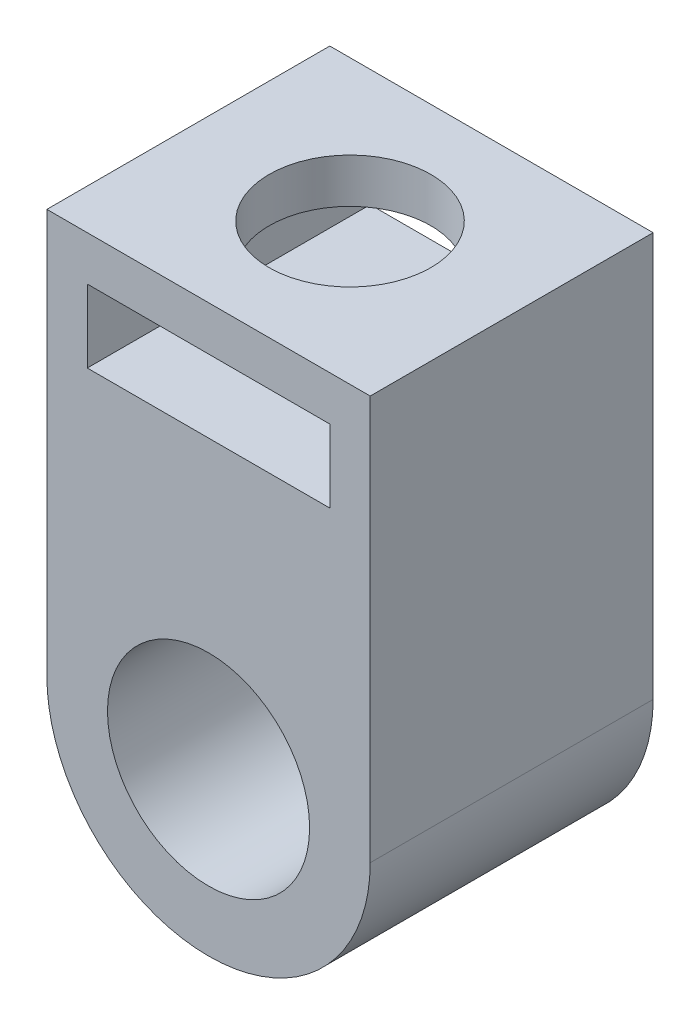
ISO-10303-21;
HEADER;
FILE_DESCRIPTION(('STEP AP214'),'2;1');
FILE_NAME('part.step','',(''),(''),'','','');
FILE_SCHEMA(('AUTOMOTIVE_DESIGN { 1 0 10303 214 1 1 1 1 }'));
ENDSEC;
DATA;
#1=APPLICATION_CONTEXT('core data for automotive mechanical design processes');
#2=APPLICATION_PROTOCOL_DEFINITION('international standard','automotive_design',2000,#1);
#3=PRODUCT_CONTEXT('',#1,'mechanical');
#4=PRODUCT('Part','Part','',(#3));
#5=PRODUCT_RELATED_PRODUCT_CATEGORY('part','',(#4));
#6=PRODUCT_DEFINITION_FORMATION('','',#4);
#7=PRODUCT_DEFINITION_CONTEXT('part definition',#1,'design');
#8=PRODUCT_DEFINITION('design','',#6,#7);
#9=PRODUCT_DEFINITION_SHAPE('','',#8);
#10=(LENGTH_UNIT() NAMED_UNIT(*) SI_UNIT(.MILLI.,.METRE.));
#11=(NAMED_UNIT(*) PLANE_ANGLE_UNIT() SI_UNIT($,.RADIAN.));
#12=(NAMED_UNIT(*) SI_UNIT($,.STERADIAN.) SOLID_ANGLE_UNIT());
#13=UNCERTAINTY_MEASURE_WITH_UNIT(LENGTH_MEASURE(1.E-05),#10,'distance_accuracy_value','');
#14=(GEOMETRIC_REPRESENTATION_CONTEXT(3) GLOBAL_UNCERTAINTY_ASSIGNED_CONTEXT((#13)) GLOBAL_UNIT_ASSIGNED_CONTEXT((#10,
#11,#12)) REPRESENTATION_CONTEXT('',''));
#15=CARTESIAN_POINT('',(0.,0.,0.));
#16=DIRECTION('',(0.,0.,1.));
#17=DIRECTION('',(1.,0.,0.));
#18=AXIS2_PLACEMENT_3D('',#15,#16,#17);
#19=CARTESIAN_POINT('',(0.,0.,7.));
#20=DIRECTION('',(0.,0.,1.));
#21=DIRECTION('',(1.,0.,0.));
#22=AXIS2_PLACEMENT_3D('',#19,#20,#21);
#23=PLANE('',#22);
#24=DIRECTION('',(0.,-1.,0.));
#25=VECTOR('',#24,1.);
#26=CARTESIAN_POINT('',(-3.,8.9,7.));
#27=LINE('',#26,#25);
#28=CARTESIAN_POINT('',(-3.,8.9,7.));
#29=VERTEX_POINT('',#28);
#30=CARTESIAN_POINT('',(-3.,7.1,7.));
#31=VERTEX_POINT('',#30);
#32=EDGE_CURVE('E56',#29,#31,#27,.T.);
#33=ORIENTED_EDGE('',*,*,#32,.F.);
#34=DIRECTION('',(-1.,0.,0.));
#35=VECTOR('',#34,1.);
#36=CARTESIAN_POINT('',(3.,8.9,7.));
#37=LINE('',#36,#35);
#38=CARTESIAN_POINT('',(3.,8.9,7.));
#39=VERTEX_POINT('',#38);
#40=EDGE_CURVE('E127',#39,#29,#37,.T.);
#41=ORIENTED_EDGE('',*,*,#40,.F.);
#42=DIRECTION('',(0.,1.,0.));
#43=VECTOR('',#42,1.);
#44=CARTESIAN_POINT('',(3.,8.9,7.));
#45=LINE('',#44,#43);
#46=CARTESIAN_POINT('',(3.,7.1,7.));
#47=VERTEX_POINT('',#46);
#48=EDGE_CURVE('E131',#47,#39,#45,.T.);
#49=ORIENTED_EDGE('',*,*,#48,.F.);
#50=DIRECTION('',(1.,0.,0.));
#51=VECTOR('',#50,1.);
#52=CARTESIAN_POINT('',(3.,7.1,7.));
#53=LINE('',#52,#51);
#54=EDGE_CURVE('E142',#31,#47,#53,.T.);
#55=ORIENTED_EDGE('',*,*,#54,.F.);
#56=EDGE_LOOP('',(#33,#41,#49,#55));
#57=FACE_BOUND('',#56,.T.);
#58=CARTESIAN_POINT('',(0.,0.,7.));
#59=DIRECTION('',(0.,0.,1.));
#60=DIRECTION('',(1.,0.,0.));
#61=AXIS2_PLACEMENT_3D('',#58,#59,#60);
#62=CIRCLE('',#61,4.);
#63=CARTESIAN_POINT('',(-4.,0.,7.));
#64=VERTEX_POINT('',#63);
#65=CARTESIAN_POINT('',(4.,0.,7.));
#66=VERTEX_POINT('',#65);
#67=EDGE_CURVE('E165',#64,#66,#62,.T.);
#68=ORIENTED_EDGE('',*,*,#67,.T.);
#69=DIRECTION('',(0.,1.,0.));
#70=VECTOR('',#69,1.);
#71=CARTESIAN_POINT('',(4.,0.,7.));
#72=LINE('',#71,#70);
#73=CARTESIAN_POINT('',(4.,10.,7.));
#74=VERTEX_POINT('',#73);
#75=EDGE_CURVE('E169',#66,#74,#72,.T.);
#76=ORIENTED_EDGE('',*,*,#75,.T.);
#77=DIRECTION('',(-1.,0.,0.));
#78=VECTOR('',#77,1.);
#79=CARTESIAN_POINT('',(-4.,10.,7.));
#80=LINE('',#79,#78);
#81=CARTESIAN_POINT('',(-4.,10.,7.));
#82=VERTEX_POINT('',#81);
#83=EDGE_CURVE('E173',#74,#82,#80,.T.);
#84=ORIENTED_EDGE('',*,*,#83,.T.);
#85=DIRECTION('',(0.,-1.,0.));
#86=VECTOR('',#85,1.);
#87=CARTESIAN_POINT('',(-4.,0.,7.));
#88=LINE('',#87,#86);
#89=EDGE_CURVE('E176',#82,#64,#88,.T.);
#90=ORIENTED_EDGE('',*,*,#89,.T.);
#91=EDGE_LOOP('',(#68,#76,#84,#90));
#92=FACE_BOUND('',#91,.T.);
#93=CARTESIAN_POINT('',(0.,0.,7.));
#94=DIRECTION('',(0.,0.,1.));
#95=DIRECTION('',(1.,0.,0.));
#96=AXIS2_PLACEMENT_3D('',#93,#94,#95);
#97=CIRCLE('',#96,2.5);
#98=CARTESIAN_POINT('',(2.5,0.,7.));
#99=VERTEX_POINT('',#98);
#100=EDGE_CURVE('E157',#99,#99,#97,.T.);
#101=ORIENTED_EDGE('',*,*,#100,.F.);
#102=EDGE_LOOP('',(#101));
#103=FACE_BOUND('',#102,.T.);
#104=ADVANCED_FACE('F39',(#57,#92,#103),#23,.T.);
#105=CARTESIAN_POINT('',(0.,0.,0.));
#106=DIRECTION('',(0.,0.,1.));
#107=DIRECTION('',(1.,0.,0.));
#108=AXIS2_PLACEMENT_3D('',#105,#106,#107);
#109=PLANE('',#108);
#110=DIRECTION('',(-1.,0.,0.));
#111=VECTOR('',#110,1.);
#112=CARTESIAN_POINT('',(3.,8.9,0.));
#113=LINE('',#112,#111);
#114=CARTESIAN_POINT('',(3.,8.9,0.));
#115=VERTEX_POINT('',#114);
#116=CARTESIAN_POINT('',(-3.,8.9,0.));
#117=VERTEX_POINT('',#116);
#118=EDGE_CURVE('E115',#115,#117,#113,.T.);
#119=ORIENTED_EDGE('',*,*,#118,.T.);
#120=DIRECTION('',(0.,-1.,0.));
#121=VECTOR('',#120,1.);
#122=CARTESIAN_POINT('',(-3.,8.9,0.));
#123=LINE('',#122,#121);
#124=CARTESIAN_POINT('',(-3.,7.1,0.));
#125=VERTEX_POINT('',#124);
#126=EDGE_CURVE('E108',#117,#125,#123,.T.);
#127=ORIENTED_EDGE('',*,*,#126,.T.);
#128=DIRECTION('',(1.,0.,0.));
#129=VECTOR('',#128,1.);
#130=CARTESIAN_POINT('',(3.,7.1,0.));
#131=LINE('',#130,#129);
#132=CARTESIAN_POINT('',(3.,7.1,0.));
#133=VERTEX_POINT('',#132);
#134=EDGE_CURVE('E118',#125,#133,#131,.T.);
#135=ORIENTED_EDGE('',*,*,#134,.T.);
#136=DIRECTION('',(0.,1.,0.));
#137=VECTOR('',#136,1.);
#138=CARTESIAN_POINT('',(3.,8.9,0.));
#139=LINE('',#138,#137);
#140=EDGE_CURVE('E64',#133,#115,#139,.T.);
#141=ORIENTED_EDGE('',*,*,#140,.T.);
#142=EDGE_LOOP('',(#119,#127,#135,#141));
#143=FACE_BOUND('',#142,.T.);
#144=CARTESIAN_POINT('',(0.,0.,0.));
#145=DIRECTION('',(0.,0.,1.));
#146=DIRECTION('',(1.,0.,0.));
#147=AXIS2_PLACEMENT_3D('',#144,#145,#146);
#148=CIRCLE('',#147,4.);
#149=CARTESIAN_POINT('',(-4.,0.,0.));
#150=VERTEX_POINT('',#149);
#151=CARTESIAN_POINT('',(4.,0.,0.));
#152=VERTEX_POINT('',#151);
#153=EDGE_CURVE('E161',#150,#152,#148,.T.);
#154=ORIENTED_EDGE('',*,*,#153,.F.);
#155=DIRECTION('',(0.,-1.,0.));
#156=VECTOR('',#155,1.);
#157=CARTESIAN_POINT('',(-4.,0.,0.));
#158=LINE('',#157,#156);
#159=CARTESIAN_POINT('',(-4.,10.,0.));
#160=VERTEX_POINT('',#159);
#161=EDGE_CURVE('E170',#160,#150,#158,.T.);
#162=ORIENTED_EDGE('',*,*,#161,.F.);
#163=DIRECTION('',(-1.,0.,0.));
#164=VECTOR('',#163,1.);
#165=CARTESIAN_POINT('',(-4.,10.,0.));
#166=LINE('',#165,#164);
#167=CARTESIAN_POINT('',(4.,10.,0.));
#168=VERTEX_POINT('',#167);
#169=EDGE_CURVE('E186',#168,#160,#166,.T.);
#170=ORIENTED_EDGE('',*,*,#169,.F.);
#171=DIRECTION('',(0.,1.,0.));
#172=VECTOR('',#171,1.);
#173=CARTESIAN_POINT('',(4.,0.,0.));
#174=LINE('',#173,#172);
#175=EDGE_CURVE('E183',#152,#168,#174,.T.);
#176=ORIENTED_EDGE('',*,*,#175,.F.);
#177=EDGE_LOOP('',(#154,#162,#170,#176));
#178=FACE_BOUND('',#177,.T.);
#179=CARTESIAN_POINT('',(0.,0.,0.));
#180=DIRECTION('',(0.,0.,1.));
#181=DIRECTION('',(1.,0.,0.));
#182=AXIS2_PLACEMENT_3D('',#179,#180,#181);
#183=CIRCLE('',#182,2.5);
#184=CARTESIAN_POINT('',(2.5,0.,0.));
#185=VERTEX_POINT('',#184);
#186=EDGE_CURVE('E151',#185,#185,#183,.T.);
#187=ORIENTED_EDGE('',*,*,#186,.T.);
#188=EDGE_LOOP('',(#187));
#189=FACE_BOUND('',#188,.T.);
#190=ADVANCED_FACE('F123',(#143,#178,#189),#109,.F.);
#191=CARTESIAN_POINT('',(0.,0.,7.));
#192=DIRECTION('',(0.,0.,-1.));
#193=DIRECTION('',(-1.,0.,0.));
#194=AXIS2_PLACEMENT_3D('',#191,#192,#193);
#195=CYLINDRICAL_SURFACE('',#194,4.);
#196=ORIENTED_EDGE('',*,*,#153,.T.);
#197=DIRECTION('',(0.,0.,-1.));
#198=VECTOR('',#197,1.);
#199=CARTESIAN_POINT('',(4.,0.,7.));
#200=LINE('',#199,#198);
#201=EDGE_CURVE('E11',#66,#152,#200,.T.);
#202=ORIENTED_EDGE('',*,*,#201,.F.);
#203=ORIENTED_EDGE('',*,*,#67,.F.);
#204=DIRECTION('',(0.,0.,-1.));
#205=VECTOR('',#204,1.);
#206=CARTESIAN_POINT('',(-4.,0.,7.));
#207=LINE('',#206,#205);
#208=EDGE_CURVE('E179',#64,#150,#207,.T.);
#209=ORIENTED_EDGE('',*,*,#208,.T.);
#210=EDGE_LOOP('',(#196,#202,#203,#209));
#211=FACE_BOUND('',#210,.T.);
#212=ADVANCED_FACE('F41',(#211),#195,.T.);
#213=CARTESIAN_POINT('',(4.,0.,7.));
#214=DIRECTION('',(-1.,0.,0.));
#215=DIRECTION('',(0.,0.,1.));
#216=AXIS2_PLACEMENT_3D('',#213,#214,#215);
#217=PLANE('',#216);
#218=ORIENTED_EDGE('',*,*,#175,.T.);
#219=DIRECTION('',(0.,0.,-1.));
#220=VECTOR('',#219,1.);
#221=CARTESIAN_POINT('',(4.,10.,7.));
#222=LINE('',#221,#220);
#223=EDGE_CURVE('E49',#74,#168,#222,.T.);
#224=ORIENTED_EDGE('',*,*,#223,.F.);
#225=ORIENTED_EDGE('',*,*,#75,.F.);
#226=ORIENTED_EDGE('',*,*,#201,.T.);
#227=EDGE_LOOP('',(#218,#224,#225,#226));
#228=FACE_BOUND('',#227,.T.);
#229=ADVANCED_FACE('F219',(#228),#217,.F.);
#230=CARTESIAN_POINT('',(-4.,10.,7.));
#231=DIRECTION('',(0.,-1.,0.));
#232=DIRECTION('',(0.,0.,-1.));
#233=AXIS2_PLACEMENT_3D('',#230,#231,#232);
#234=PLANE('',#233);
#235=CARTESIAN_POINT('',(0.,10.,3.5));
#236=DIRECTION('',(0.,1.,0.));
#237=DIRECTION('',(0.,0.,1.));
#238=AXIS2_PLACEMENT_3D('',#235,#236,#237);
#239=CIRCLE('',#238,2.);
#240=CARTESIAN_POINT('',(0.,10.,5.5));
#241=VERTEX_POINT('',#240);
#242=EDGE_CURVE('E134',#241,#241,#239,.T.);
#243=ORIENTED_EDGE('',*,*,#242,.F.);
#244=EDGE_LOOP('',(#243));
#245=FACE_BOUND('',#244,.T.);
#246=ORIENTED_EDGE('',*,*,#169,.T.);
#247=DIRECTION('',(0.,0.,-1.));
#248=VECTOR('',#247,1.);
#249=CARTESIAN_POINT('',(-4.,10.,7.));
#250=LINE('',#249,#248);
#251=EDGE_CURVE('E194',#82,#160,#250,.T.);
#252=ORIENTED_EDGE('',*,*,#251,.F.);
#253=ORIENTED_EDGE('',*,*,#83,.F.);
#254=ORIENTED_EDGE('',*,*,#223,.T.);
#255=EDGE_LOOP('',(#246,#252,#253,#254));
#256=FACE_BOUND('',#255,.T.);
#257=ADVANCED_FACE('F204',(#245,#256),#234,.F.);
#258=CARTESIAN_POINT('',(-4.,0.,7.));
#259=DIRECTION('',(1.,0.,0.));
#260=DIRECTION('',(0.,0.,-1.));
#261=AXIS2_PLACEMENT_3D('',#258,#259,#260);
#262=PLANE('',#261);
#263=ORIENTED_EDGE('',*,*,#161,.T.);
#264=ORIENTED_EDGE('',*,*,#208,.F.);
#265=ORIENTED_EDGE('',*,*,#89,.F.);
#266=ORIENTED_EDGE('',*,*,#251,.T.);
#267=EDGE_LOOP('',(#263,#264,#265,#266));
#268=FACE_BOUND('',#267,.T.);
#269=ADVANCED_FACE('F212',(#268),#262,.F.);
#270=CARTESIAN_POINT('',(0.,0.,7.));
#271=DIRECTION('',(0.,0.,-1.));
#272=DIRECTION('',(-1.,0.,0.));
#273=AXIS2_PLACEMENT_3D('',#270,#271,#272);
#274=CYLINDRICAL_SURFACE('',#273,2.5);
#275=ORIENTED_EDGE('',*,*,#100,.T.);
#276=EDGE_LOOP('',(#275));
#277=FACE_BOUND('',#276,.T.);
#278=ORIENTED_EDGE('',*,*,#186,.F.);
#279=EDGE_LOOP('',(#278));
#280=FACE_BOUND('',#279,.T.);
#281=ADVANCED_FACE('F235',(#277,#280),#274,.F.);
#282=CARTESIAN_POINT('',(-3.,8.9,0.));
#283=DIRECTION('',(-1.,0.,0.));
#284=DIRECTION('',(0.,0.,1.));
#285=AXIS2_PLACEMENT_3D('',#282,#283,#284);
#286=PLANE('',#285);
#287=ORIENTED_EDGE('',*,*,#32,.T.);
#288=DIRECTION('',(0.,0.,1.));
#289=VECTOR('',#288,1.);
#290=CARTESIAN_POINT('',(-3.,7.1,0.));
#291=LINE('',#290,#289);
#292=EDGE_CURVE('E104',#125,#31,#291,.T.);
#293=ORIENTED_EDGE('',*,*,#292,.F.);
#294=ORIENTED_EDGE('',*,*,#126,.F.);
#295=DIRECTION('',(0.,0.,1.));
#296=VECTOR('',#295,1.);
#297=CARTESIAN_POINT('',(-3.,8.9,0.));
#298=LINE('',#297,#296);
#299=EDGE_CURVE('E148',#117,#29,#298,.T.);
#300=ORIENTED_EDGE('',*,*,#299,.T.);
#301=EDGE_LOOP('',(#287,#293,#294,#300));
#302=FACE_BOUND('',#301,.T.);
#303=ADVANCED_FACE('F106',(#302),#286,.F.);
#304=CARTESIAN_POINT('',(3.,8.9,0.));
#305=DIRECTION('',(0.,1.,0.));
#306=DIRECTION('',(0.,0.,1.));
#307=AXIS2_PLACEMENT_3D('',#304,#305,#306);
#308=PLANE('',#307);
#309=CARTESIAN_POINT('',(0.,8.9,3.5));
#310=DIRECTION('',(0.,1.,0.));
#311=DIRECTION('',(0.,0.,1.));
#312=AXIS2_PLACEMENT_3D('',#309,#310,#311);
#313=CIRCLE('',#312,2.);
#314=CARTESIAN_POINT('',(0.,8.9,5.5));
#315=VERTEX_POINT('',#314);
#316=EDGE_CURVE('E43',#315,#315,#313,.T.);
#317=ORIENTED_EDGE('',*,*,#316,.T.);
#318=EDGE_LOOP('',(#317));
#319=FACE_BOUND('',#318,.T.);
#320=ORIENTED_EDGE('',*,*,#40,.T.);
#321=ORIENTED_EDGE('',*,*,#299,.F.);
#322=ORIENTED_EDGE('',*,*,#118,.F.);
#323=DIRECTION('',(0.,0.,1.));
#324=VECTOR('',#323,1.);
#325=CARTESIAN_POINT('',(3.,8.9,0.));
#326=LINE('',#325,#324);
#327=EDGE_CURVE('E152',#115,#39,#326,.T.);
#328=ORIENTED_EDGE('',*,*,#327,.T.);
#329=EDGE_LOOP('',(#320,#321,#322,#328));
#330=FACE_BOUND('',#329,.T.);
#331=ADVANCED_FACE('F246',(#319,#330),#308,.F.);
#332=CARTESIAN_POINT('',(3.,8.9,0.));
#333=DIRECTION('',(1.,0.,0.));
#334=DIRECTION('',(0.,1.,0.));
#335=AXIS2_PLACEMENT_3D('',#332,#333,#334);
#336=PLANE('',#335);
#337=ORIENTED_EDGE('',*,*,#48,.T.);
#338=ORIENTED_EDGE('',*,*,#327,.F.);
#339=ORIENTED_EDGE('',*,*,#140,.F.);
#340=DIRECTION('',(0.,0.,1.));
#341=VECTOR('',#340,1.);
#342=CARTESIAN_POINT('',(3.,7.1,0.));
#343=LINE('',#342,#341);
#344=EDGE_CURVE('E114',#133,#47,#343,.T.);
#345=ORIENTED_EDGE('',*,*,#344,.T.);
#346=EDGE_LOOP('',(#337,#338,#339,#345));
#347=FACE_BOUND('',#346,.T.);
#348=ADVANCED_FACE('F253',(#347),#336,.F.);
#349=CARTESIAN_POINT('',(3.,7.1,0.));
#350=DIRECTION('',(0.,-1.,0.));
#351=DIRECTION('',(1.,0.,0.));
#352=AXIS2_PLACEMENT_3D('',#349,#350,#351);
#353=PLANE('',#352);
#354=ORIENTED_EDGE('',*,*,#54,.T.);
#355=ORIENTED_EDGE('',*,*,#344,.F.);
#356=ORIENTED_EDGE('',*,*,#134,.F.);
#357=ORIENTED_EDGE('',*,*,#292,.T.);
#358=EDGE_LOOP('',(#354,#355,#356,#357));
#359=FACE_BOUND('',#358,.T.);
#360=ADVANCED_FACE('F119',(#359),#353,.F.);
#361=CARTESIAN_POINT('',(0.,8.,3.5));
#362=DIRECTION('',(0.,1.,0.));
#363=DIRECTION('',(0.,0.,1.));
#364=AXIS2_PLACEMENT_3D('',#361,#362,#363);
#365=CYLINDRICAL_SURFACE('',#364,2.);
#366=ORIENTED_EDGE('',*,*,#242,.T.);
#367=EDGE_LOOP('',(#366));
#368=FACE_BOUND('',#367,.T.);
#369=ORIENTED_EDGE('',*,*,#316,.F.);
#370=EDGE_LOOP('',(#369));
#371=FACE_BOUND('',#370,.T.);
#372=ADVANCED_FACE('F259',(#368,#371),#365,.F.);
#373=CLOSED_SHELL('',(#104,#190,#212,#229,#257,#269,#281,#303,#331,#348,#360,#372));
#374=MANIFOLD_SOLID_BREP('B2',#373);
#375=ADVANCED_BREP_SHAPE_REPRESENTATION('',(#18,#374),#14);
#376=SHAPE_DEFINITION_REPRESENTATION(#9,#375);
ENDSEC;
END-ISO-10303-21;
